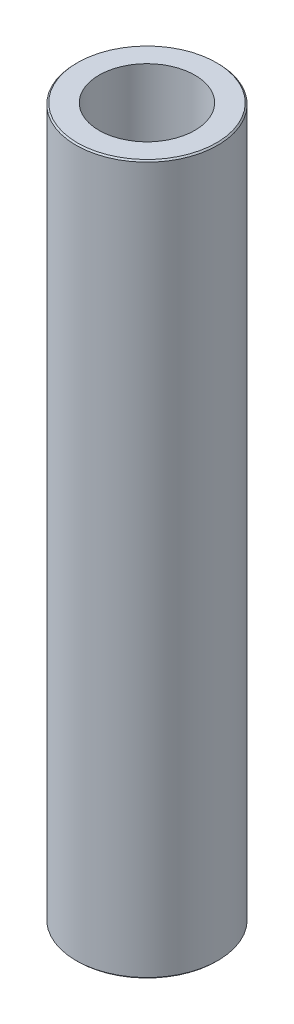
ISO-10303-21;
HEADER;
FILE_DESCRIPTION(('STEP AP214'),'2;1');
FILE_NAME('part.step','',(''),(''),'','','');
FILE_SCHEMA(('AUTOMOTIVE_DESIGN { 1 0 10303 214 1 1 1 1 }'));
ENDSEC;
DATA;
#1=APPLICATION_CONTEXT('core data for automotive mechanical design processes');
#2=APPLICATION_PROTOCOL_DEFINITION('international standard','automotive_design',2000,#1);
#3=PRODUCT_CONTEXT('',#1,'mechanical');
#4=PRODUCT('Part','Part','',(#3));
#5=PRODUCT_RELATED_PRODUCT_CATEGORY('part','',(#4));
#6=PRODUCT_DEFINITION_FORMATION('','',#4);
#7=PRODUCT_DEFINITION_CONTEXT('part definition',#1,'design');
#8=PRODUCT_DEFINITION('design','',#6,#7);
#9=PRODUCT_DEFINITION_SHAPE('','',#8);
#10=(LENGTH_UNIT() NAMED_UNIT(*) SI_UNIT(.MILLI.,.METRE.));
#11=(NAMED_UNIT(*) PLANE_ANGLE_UNIT() SI_UNIT($,.RADIAN.));
#12=(NAMED_UNIT(*) SI_UNIT($,.STERADIAN.) SOLID_ANGLE_UNIT());
#13=UNCERTAINTY_MEASURE_WITH_UNIT(LENGTH_MEASURE(1.E-05),#10,'distance_accuracy_value','');
#14=(GEOMETRIC_REPRESENTATION_CONTEXT(3) GLOBAL_UNCERTAINTY_ASSIGNED_CONTEXT((#13)) GLOBAL_UNIT_ASSIGNED_CONTEXT((#10,
#11,#12)) REPRESENTATION_CONTEXT('',''));
#15=CARTESIAN_POINT('',(0.,0.,0.));
#16=DIRECTION('',(0.,0.,1.));
#17=DIRECTION('',(1.,0.,0.));
#18=AXIS2_PLACEMENT_3D('',#15,#16,#17);
#19=CARTESIAN_POINT('',(0.,600.,0.));
#20=DIRECTION('',(0.,-1.,0.));
#21=DIRECTION('',(0.,0.,-1.));
#22=AXIS2_PLACEMENT_3D('',#19,#20,#21);
#23=CYLINDRICAL_SURFACE('',#22,60.);
#24=CARTESIAN_POINT('',(0.,598.832505950359,0.));
#25=DIRECTION('',(0.,1.,0.));
#26=DIRECTION('',(0.,0.,1.));
#27=AXIS2_PLACEMENT_3D('',#24,#25,#26);
#28=CIRCLE('',#27,60.);
#29=CARTESIAN_POINT('',(0.,598.832505950359,60.));
#30=VERTEX_POINT('',#29);
#31=EDGE_CURVE('E50',#30,#30,#28,.F.);
#32=ORIENTED_EDGE('',*,*,#31,.T.);
#33=EDGE_LOOP('',(#32));
#34=FACE_BOUND('',#33,.T.);
#35=CARTESIAN_POINT('',(0.,1.16749404964056,0.));
#36=DIRECTION('',(0.,1.,0.));
#37=DIRECTION('',(0.,0.,1.));
#38=AXIS2_PLACEMENT_3D('',#35,#36,#37);
#39=CIRCLE('',#38,60.);
#40=CARTESIAN_POINT('',(0.,1.16749404964056,60.));
#41=VERTEX_POINT('',#40);
#42=EDGE_CURVE('E51',#41,#41,#39,.T.);
#43=ORIENTED_EDGE('',*,*,#42,.T.);
#44=EDGE_LOOP('',(#43));
#45=FACE_BOUND('',#44,.T.);
#46=ADVANCED_FACE('F39',(#34,#45),#23,.T.);
#47=CARTESIAN_POINT('',(0.,600.,0.));
#48=DIRECTION('',(0.,1.,0.));
#49=DIRECTION('',(0.,0.,1.));
#50=AXIS2_PLACEMENT_3D('',#47,#48,#49);
#51=PLANE('',#50);
#52=CARTESIAN_POINT('',(0.,600.,0.));
#53=DIRECTION('',(0.,1.,0.));
#54=DIRECTION('',(0.,0.,1.));
#55=AXIS2_PLACEMENT_3D('',#52,#53,#54);
#56=CIRCLE('',#55,58.8325059503593);
#57=CARTESIAN_POINT('',(0.,600.,58.8325059503593));
#58=VERTEX_POINT('',#57);
#59=EDGE_CURVE('E54',#58,#58,#56,.T.);
#60=ORIENTED_EDGE('',*,*,#59,.T.);
#61=EDGE_LOOP('',(#60));
#62=FACE_BOUND('',#61,.T.);
#63=CARTESIAN_POINT('',(0.,600.,0.));
#64=DIRECTION('',(0.,1.,0.));
#65=DIRECTION('',(0.,0.,1.));
#66=AXIS2_PLACEMENT_3D('',#63,#64,#65);
#67=CIRCLE('',#66,40.5504339461193);
#68=CARTESIAN_POINT('',(0.,600.,40.5504339461193));
#69=VERTEX_POINT('',#68);
#70=EDGE_CURVE('E58',#69,#69,#67,.T.);
#71=ORIENTED_EDGE('',*,*,#70,.F.);
#72=EDGE_LOOP('',(#71));
#73=FACE_BOUND('',#72,.T.);
#74=ADVANCED_FACE('F69',(#62,#73),#51,.T.);
#75=CARTESIAN_POINT('',(0.,0.,0.));
#76=DIRECTION('',(0.,1.,0.));
#77=DIRECTION('',(0.,0.,1.));
#78=AXIS2_PLACEMENT_3D('',#75,#76,#77);
#79=PLANE('',#78);
#80=CARTESIAN_POINT('',(0.,0.,0.));
#81=DIRECTION('',(0.,1.,0.));
#82=DIRECTION('',(0.,0.,1.));
#83=AXIS2_PLACEMENT_3D('',#80,#81,#82);
#84=CIRCLE('',#83,58.8325059503595);
#85=CARTESIAN_POINT('',(0.,0.,58.8325059503595));
#86=VERTEX_POINT('',#85);
#87=EDGE_CURVE('E10',#86,#86,#84,.F.);
#88=ORIENTED_EDGE('',*,*,#87,.T.);
#89=EDGE_LOOP('',(#88));
#90=FACE_BOUND('',#89,.T.);
#91=CARTESIAN_POINT('',(0.,0.,0.));
#92=DIRECTION('',(0.,1.,0.));
#93=DIRECTION('',(0.,0.,1.));
#94=AXIS2_PLACEMENT_3D('',#91,#92,#93);
#95=CIRCLE('',#94,40.5504339461193);
#96=CARTESIAN_POINT('',(0.,0.,40.5504339461193));
#97=VERTEX_POINT('',#96);
#98=EDGE_CURVE('E63',#97,#97,#95,.T.);
#99=ORIENTED_EDGE('',*,*,#98,.T.);
#100=EDGE_LOOP('',(#99));
#101=FACE_BOUND('',#100,.T.);
#102=ADVANCED_FACE('F75',(#90,#101),#79,.F.);
#103=CARTESIAN_POINT('',(0.,600.,0.));
#104=DIRECTION('',(0.,-1.,0.));
#105=DIRECTION('',(0.,0.,-1.));
#106=AXIS2_PLACEMENT_3D('',#103,#104,#105);
#107=CYLINDRICAL_SURFACE('',#106,40.5504339461193);
#108=ORIENTED_EDGE('',*,*,#70,.T.);
#109=EDGE_LOOP('',(#108));
#110=FACE_BOUND('',#109,.T.);
#111=ORIENTED_EDGE('',*,*,#98,.F.);
#112=EDGE_LOOP('',(#111));
#113=FACE_BOUND('',#112,.T.);
#114=ADVANCED_FACE('F70',(#110,#113),#107,.F.);
#115=CARTESIAN_POINT('',(0.,600.,0.));
#116=DIRECTION('',(0.,-1.,0.));
#117=DIRECTION('',(0.,0.,-1.));
#118=AXIS2_PLACEMENT_3D('',#115,#116,#117);
#119=CONICAL_SURFACE('',#118,58.8325059503593,0.785398163397445);
#120=ORIENTED_EDGE('',*,*,#31,.F.);
#121=EDGE_LOOP('',(#120));
#122=FACE_BOUND('',#121,.T.);
#123=ORIENTED_EDGE('',*,*,#59,.F.);
#124=EDGE_LOOP('',(#123));
#125=FACE_BOUND('',#124,.T.);
#126=ADVANCED_FACE('F81',(#122,#125),#119,.T.);
#127=CARTESIAN_POINT('',(0.,1.16749404964056,0.));
#128=DIRECTION('',(0.,1.,0.));
#129=DIRECTION('',(0.,0.,1.));
#130=AXIS2_PLACEMENT_3D('',#127,#128,#129);
#131=CONICAL_SURFACE('',#130,60.,0.785398163397425);
#132=ORIENTED_EDGE('',*,*,#87,.F.);
#133=EDGE_LOOP('',(#132));
#134=FACE_BOUND('',#133,.T.);
#135=ORIENTED_EDGE('',*,*,#42,.F.);
#136=EDGE_LOOP('',(#135));
#137=FACE_BOUND('',#136,.T.);
#138=ADVANCED_FACE('F45',(#134,#137),#131,.T.);
#139=CLOSED_SHELL('',(#46,#74,#102,#114,#126,#138));
#140=MANIFOLD_SOLID_BREP('B2',#139);
#141=ADVANCED_BREP_SHAPE_REPRESENTATION('',(#18,#140),#14);
#142=SHAPE_DEFINITION_REPRESENTATION(#9,#141);
ENDSEC;
END-ISO-10303-21;
